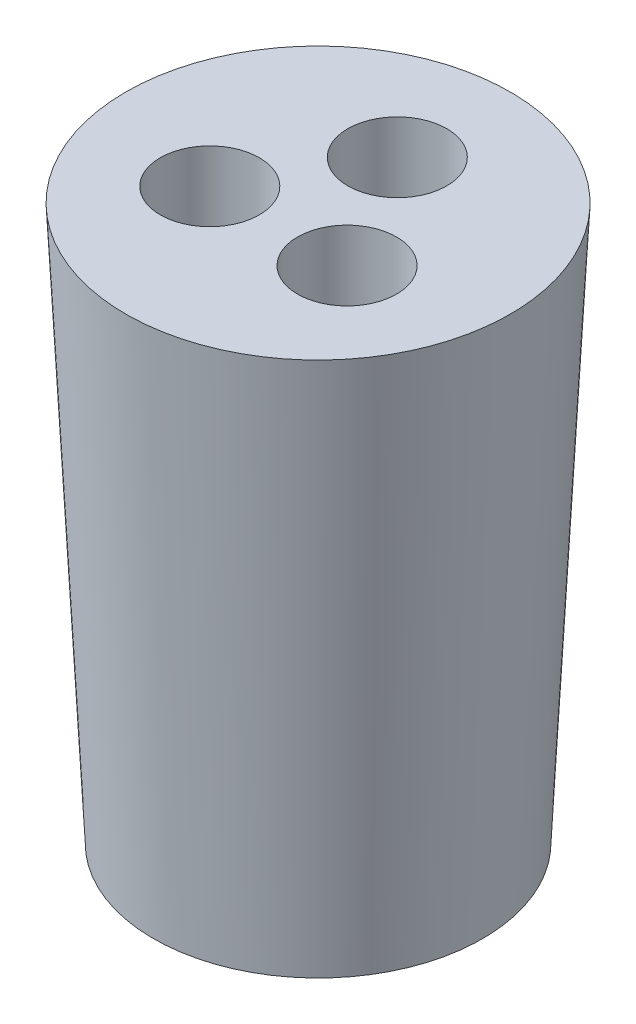
ISO-10303-21;
HEADER;
FILE_DESCRIPTION(('STEP AP214'),'2;1');
FILE_NAME('part.step','',(''),(''),'','','');
FILE_SCHEMA(('AUTOMOTIVE_DESIGN { 1 0 10303 214 1 1 1 1 }'));
ENDSEC;
DATA;
#1=APPLICATION_CONTEXT('core data for automotive mechanical design processes');
#2=APPLICATION_PROTOCOL_DEFINITION('international standard','automotive_design',2000,#1);
#3=PRODUCT_CONTEXT('',#1,'mechanical');
#4=PRODUCT('Part','Part','',(#3));
#5=PRODUCT_RELATED_PRODUCT_CATEGORY('part','',(#4));
#6=PRODUCT_DEFINITION_FORMATION('','',#4);
#7=PRODUCT_DEFINITION_CONTEXT('part definition',#1,'design');
#8=PRODUCT_DEFINITION('design','',#6,#7);
#9=PRODUCT_DEFINITION_SHAPE('','',#8);
#10=(LENGTH_UNIT() NAMED_UNIT(*) SI_UNIT(.MILLI.,.METRE.));
#11=(NAMED_UNIT(*) PLANE_ANGLE_UNIT() SI_UNIT($,.RADIAN.));
#12=(NAMED_UNIT(*) SI_UNIT($,.STERADIAN.) SOLID_ANGLE_UNIT());
#13=UNCERTAINTY_MEASURE_WITH_UNIT(LENGTH_MEASURE(1.E-05),#10,'distance_accuracy_value','');
#14=(GEOMETRIC_REPRESENTATION_CONTEXT(3) GLOBAL_UNCERTAINTY_ASSIGNED_CONTEXT((#13)) GLOBAL_UNIT_ASSIGNED_CONTEXT((#10,
#11,#12)) REPRESENTATION_CONTEXT('',''));
#15=CARTESIAN_POINT('',(0.,0.,0.));
#16=DIRECTION('',(0.,0.,1.));
#17=DIRECTION('',(1.,0.,0.));
#18=AXIS2_PLACEMENT_3D('',#15,#16,#17);
#19=CARTESIAN_POINT('',(0.,0.,0.));
#20=DIRECTION('',(0.,1.,0.));
#21=DIRECTION('',(-1.,0.,0.));
#22=AXIS2_PLACEMENT_3D('',#19,#20,#21);
#23=PLANE('',#22);
#24=CARTESIAN_POINT('',(2.92548561838615E-13,0.,-5.08));
#25=DIRECTION('',(0.,1.,0.));
#26=DIRECTION('',(-1.,0.,0.));
#27=AXIS2_PLACEMENT_3D('',#24,#25,#26);
#28=CIRCLE('',#27,3.175);
#29=CARTESIAN_POINT('',(-3.17499999999971,0.,-5.08));
#30=VERTEX_POINT('',#29);
#31=EDGE_CURVE('E49',#30,#30,#28,.T.);
#32=ORIENTED_EDGE('',*,*,#31,.T.);
#33=EDGE_LOOP('',(#32));
#34=FACE_BOUND('',#33,.T.);
#35=CARTESIAN_POINT('',(4.39940905122506,0.,2.5400000000001));
#36=DIRECTION('',(0.,1.,0.));
#37=DIRECTION('',(-1.,0.,0.));
#38=AXIS2_PLACEMENT_3D('',#35,#36,#37);
#39=CIRCLE('',#38,3.175);
#40=CARTESIAN_POINT('',(1.22440905122506,0.,2.5400000000001));
#41=VERTEX_POINT('',#40);
#42=EDGE_CURVE('E69',#41,#41,#39,.T.);
#43=ORIENTED_EDGE('',*,*,#42,.T.);
#44=EDGE_LOOP('',(#43));
#45=FACE_BOUND('',#44,.T.);
#46=CARTESIAN_POINT('',(-4.39940905122484,0.,2.5399999999999));
#47=DIRECTION('',(0.,1.,0.));
#48=DIRECTION('',(-1.,0.,0.));
#49=AXIS2_PLACEMENT_3D('',#46,#47,#48);
#50=CIRCLE('',#49,3.175);
#51=CARTESIAN_POINT('',(-7.57440905122484,0.,2.5399999999999));
#52=VERTEX_POINT('',#51);
#53=EDGE_CURVE('E61',#52,#52,#50,.T.);
#54=ORIENTED_EDGE('',*,*,#53,.T.);
#55=EDGE_LOOP('',(#54));
#56=FACE_BOUND('',#55,.T.);
#57=CARTESIAN_POINT('',(0.,0.,0.));
#58=DIRECTION('',(0.,1.,0.));
#59=DIRECTION('',(-1.,0.,0.));
#60=AXIS2_PLACEMENT_3D('',#57,#58,#59);
#61=CIRCLE('',#60,10.55);
#62=CARTESIAN_POINT('',(-10.55,0.,0.));
#63=VERTEX_POINT('',#62);
#64=EDGE_CURVE('E44',#63,#63,#61,.T.);
#65=ORIENTED_EDGE('',*,*,#64,.F.);
#66=EDGE_LOOP('',(#65));
#67=FACE_BOUND('',#66,.T.);
#68=ADVANCED_FACE('F37',(#34,#45,#56,#67),#23,.F.);
#69=CARTESIAN_POINT('',(12.328,35.56,0.));
#70=DIRECTION('',(0.,-1.,0.));
#71=DIRECTION('',(1.,0.,0.));
#72=AXIS2_PLACEMENT_3D('',#69,#70,#71);
#73=PLANE('',#72);
#74=CARTESIAN_POINT('',(2.90457542470527E-13,35.56,-5.08));
#75=DIRECTION('',(0.,1.,0.));
#76=DIRECTION('',(-1.,0.,0.));
#77=AXIS2_PLACEMENT_3D('',#74,#75,#76);
#78=CIRCLE('',#77,3.175);
#79=CARTESIAN_POINT('',(-3.17499999999971,35.56,-5.08));
#80=VERTEX_POINT('',#79);
#81=EDGE_CURVE('E54',#80,#80,#78,.T.);
#82=ORIENTED_EDGE('',*,*,#81,.F.);
#83=EDGE_LOOP('',(#82));
#84=FACE_BOUND('',#83,.T.);
#85=CARTESIAN_POINT('',(4.39940905122506,35.56,2.5400000000001));
#86=DIRECTION('',(0.,1.,0.));
#87=DIRECTION('',(-1.,0.,0.));
#88=AXIS2_PLACEMENT_3D('',#85,#86,#87);
#89=CIRCLE('',#88,3.175);
#90=CARTESIAN_POINT('',(1.22440905122506,35.56,2.5400000000001));
#91=VERTEX_POINT('',#90);
#92=EDGE_CURVE('E65',#91,#91,#89,.T.);
#93=ORIENTED_EDGE('',*,*,#92,.F.);
#94=EDGE_LOOP('',(#93));
#95=FACE_BOUND('',#94,.T.);
#96=CARTESIAN_POINT('',(-4.39940905122484,35.56,2.5399999999999));
#97=DIRECTION('',(0.,1.,0.));
#98=DIRECTION('',(-1.,0.,0.));
#99=AXIS2_PLACEMENT_3D('',#96,#97,#98);
#100=CIRCLE('',#99,3.175);
#101=CARTESIAN_POINT('',(-7.57440905122484,35.56,2.5399999999999));
#102=VERTEX_POINT('',#101);
#103=EDGE_CURVE('E57',#102,#102,#100,.T.);
#104=ORIENTED_EDGE('',*,*,#103,.F.);
#105=EDGE_LOOP('',(#104));
#106=FACE_BOUND('',#105,.T.);
#107=CARTESIAN_POINT('',(0.,35.56,0.));
#108=DIRECTION('',(0.,1.,0.));
#109=DIRECTION('',(-1.,0.,0.));
#110=AXIS2_PLACEMENT_3D('',#107,#108,#109);
#111=CIRCLE('',#110,12.328);
#112=CARTESIAN_POINT('',(-12.328,35.56,0.));
#113=VERTEX_POINT('',#112);
#114=EDGE_CURVE('E10',#113,#113,#111,.T.);
#115=ORIENTED_EDGE('',*,*,#114,.T.);
#116=EDGE_LOOP('',(#115));
#117=FACE_BOUND('',#116,.T.);
#118=ADVANCED_FACE('F79',(#84,#95,#106,#117),#73,.F.);
#119=CARTESIAN_POINT('',(0.,0.,0.));
#120=DIRECTION('',(0.,1.,0.));
#121=DIRECTION('',(-1.,0.,0.));
#122=AXIS2_PLACEMENT_3D('',#119,#120,#121);
#123=CONICAL_SURFACE('',#122,10.55,0.0499583957219423);
#124=ORIENTED_EDGE('',*,*,#114,.F.);
#125=EDGE_LOOP('',(#124));
#126=FACE_BOUND('',#125,.T.);
#127=ORIENTED_EDGE('',*,*,#64,.T.);
#128=EDGE_LOOP('',(#127));
#129=FACE_BOUND('',#128,.T.);
#130=ADVANCED_FACE('F82',(#126,#129),#123,.T.);
#131=CARTESIAN_POINT('',(-4.39940905122484,0.,2.5399999999999));
#132=DIRECTION('',(0.,1.,0.));
#133=DIRECTION('',(-1.,0.,0.));
#134=AXIS2_PLACEMENT_3D('',#131,#132,#133);
#135=CYLINDRICAL_SURFACE('',#134,3.175);
#136=ORIENTED_EDGE('',*,*,#53,.F.);
#137=EDGE_LOOP('',(#136));
#138=FACE_BOUND('',#137,.T.);
#139=ORIENTED_EDGE('',*,*,#103,.T.);
#140=EDGE_LOOP('',(#139));
#141=FACE_BOUND('',#140,.T.);
#142=ADVANCED_FACE('F87',(#138,#141),#135,.F.);
#143=CARTESIAN_POINT('',(4.39940905122506,0.,2.5400000000001));
#144=DIRECTION('',(0.,1.,0.));
#145=DIRECTION('',(-1.,0.,0.));
#146=AXIS2_PLACEMENT_3D('',#143,#144,#145);
#147=CYLINDRICAL_SURFACE('',#146,3.175);
#148=ORIENTED_EDGE('',*,*,#42,.F.);
#149=EDGE_LOOP('',(#148));
#150=FACE_BOUND('',#149,.T.);
#151=ORIENTED_EDGE('',*,*,#92,.T.);
#152=EDGE_LOOP('',(#151));
#153=FACE_BOUND('',#152,.T.);
#154=ADVANCED_FACE('F89',(#150,#153),#147,.F.);
#155=CARTESIAN_POINT('',(2.92548561838615E-13,0.,-5.08));
#156=DIRECTION('',(0.,1.,0.));
#157=DIRECTION('',(-1.,0.,0.));
#158=AXIS2_PLACEMENT_3D('',#155,#156,#157);
#159=CYLINDRICAL_SURFACE('',#158,3.175);
#160=ORIENTED_EDGE('',*,*,#31,.F.);
#161=EDGE_LOOP('',(#160));
#162=FACE_BOUND('',#161,.T.);
#163=ORIENTED_EDGE('',*,*,#81,.T.);
#164=EDGE_LOOP('',(#163));
#165=FACE_BOUND('',#164,.T.);
#166=ADVANCED_FACE('F77',(#162,#165),#159,.F.);
#167=CLOSED_SHELL('',(#68,#118,#130,#142,#154,#166));
#168=MANIFOLD_SOLID_BREP('B2',#167);
#169=ADVANCED_BREP_SHAPE_REPRESENTATION('',(#18,#168),#14);
#170=SHAPE_DEFINITION_REPRESENTATION(#9,#169);
ENDSEC;
END-ISO-10303-21;
